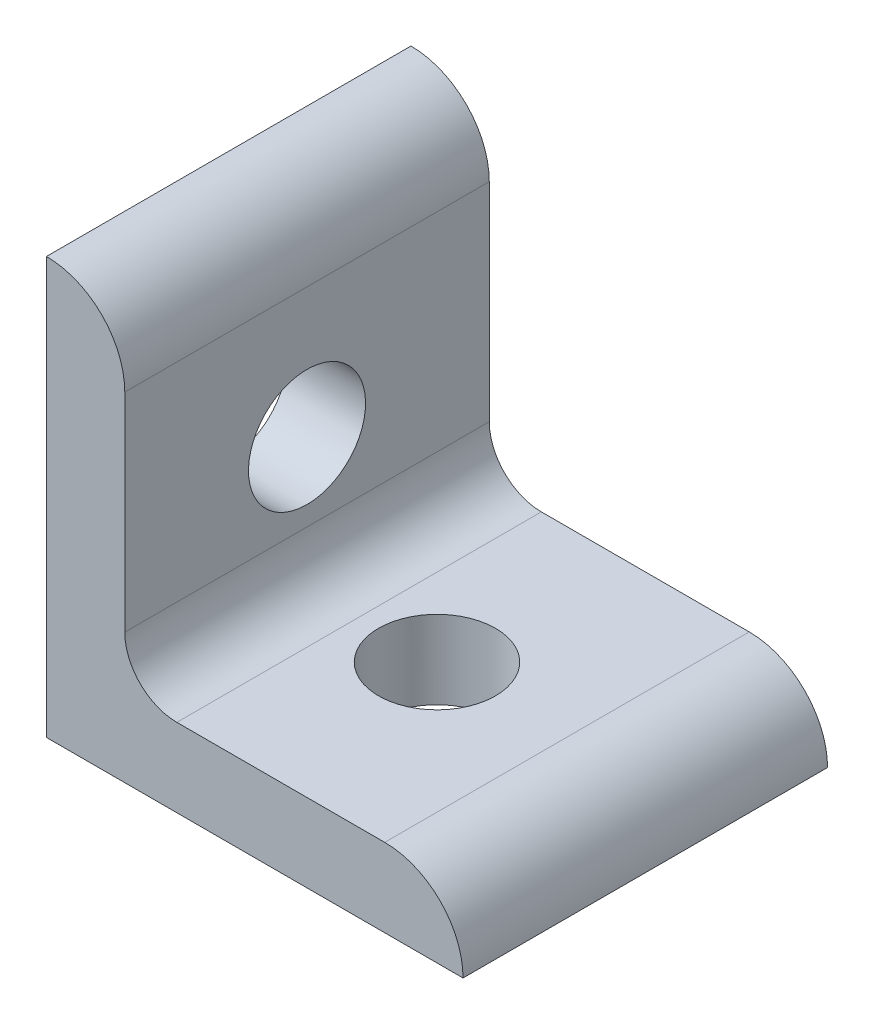
ISO-10303-21;
HEADER;
FILE_DESCRIPTION(('STEP AP214'),'2;1');
FILE_NAME('part.step','',(''),(''),'','','');
FILE_SCHEMA(('AUTOMOTIVE_DESIGN { 1 0 10303 214 1 1 1 1 }'));
ENDSEC;
DATA;
#1=APPLICATION_CONTEXT('core data for automotive mechanical design processes');
#2=APPLICATION_PROTOCOL_DEFINITION('international standard','automotive_design',2000,#1);
#3=PRODUCT_CONTEXT('',#1,'mechanical');
#4=PRODUCT('Part','Part','',(#3));
#5=PRODUCT_RELATED_PRODUCT_CATEGORY('part','',(#4));
#6=PRODUCT_DEFINITION_FORMATION('','',#4);
#7=PRODUCT_DEFINITION_CONTEXT('part definition',#1,'design');
#8=PRODUCT_DEFINITION('design','',#6,#7);
#9=PRODUCT_DEFINITION_SHAPE('','',#8);
#10=(LENGTH_UNIT() NAMED_UNIT(*) SI_UNIT(.MILLI.,.METRE.));
#11=(NAMED_UNIT(*) PLANE_ANGLE_UNIT() SI_UNIT($,.RADIAN.));
#12=(NAMED_UNIT(*) SI_UNIT($,.STERADIAN.) SOLID_ANGLE_UNIT());
#13=UNCERTAINTY_MEASURE_WITH_UNIT(LENGTH_MEASURE(1.E-05),#10,'distance_accuracy_value','');
#14=(GEOMETRIC_REPRESENTATION_CONTEXT(3) GLOBAL_UNCERTAINTY_ASSIGNED_CONTEXT((#13)) GLOBAL_UNIT_ASSIGNED_CONTEXT((#10,
#11,#12)) REPRESENTATION_CONTEXT('',''));
#15=CARTESIAN_POINT('',(0.,0.,0.));
#16=DIRECTION('',(0.,0.,1.));
#17=DIRECTION('',(1.,0.,0.));
#18=AXIS2_PLACEMENT_3D('',#15,#16,#17);
#19=CARTESIAN_POINT('',(4.7752,20.6248,11.1125));
#20=DIRECTION('',(-1.,0.,0.));
#21=DIRECTION('',(0.,-1.,0.));
#22=AXIS2_PLACEMENT_3D('',#19,#20,#21);
#23=PLANE('',#22);
#24=DIRECTION('',(0.,1.,0.));
#25=VECTOR('',#24,1.);
#26=CARTESIAN_POINT('',(4.7752,20.6248,-11.1125));
#27=LINE('',#26,#25);
#28=CARTESIAN_POINT('',(4.7752,7.9502,-11.1125));
#29=VERTEX_POINT('',#28);
#30=CARTESIAN_POINT('',(4.7752,20.6248,-11.1125));
#31=VERTEX_POINT('',#30);
#32=EDGE_CURVE('E120',#29,#31,#27,.T.);
#33=ORIENTED_EDGE('',*,*,#32,.T.);
#34=DIRECTION('',(0.,0.,-1.));
#35=VECTOR('',#34,1.);
#36=CARTESIAN_POINT('',(4.7752,20.6248,11.1125));
#37=LINE('',#36,#35);
#38=CARTESIAN_POINT('',(4.7752,20.6248,11.1125));
#39=VERTEX_POINT('',#38);
#40=EDGE_CURVE('E117',#39,#31,#37,.T.);
#41=ORIENTED_EDGE('',*,*,#40,.F.);
#42=DIRECTION('',(0.,1.,0.));
#43=VECTOR('',#42,1.);
#44=CARTESIAN_POINT('',(4.7752,20.6248,11.1125));
#45=LINE('',#44,#43);
#46=CARTESIAN_POINT('',(4.7752,7.9502,11.1125));
#47=VERTEX_POINT('',#46);
#48=EDGE_CURVE('E106',#47,#39,#45,.T.);
#49=ORIENTED_EDGE('',*,*,#48,.F.);
#50=DIRECTION('',(0.,0.,-1.));
#51=VECTOR('',#50,1.);
#52=CARTESIAN_POINT('',(4.7752,7.9502,11.1125));
#53=LINE('',#52,#51);
#54=EDGE_CURVE('E121',#47,#29,#53,.T.);
#55=ORIENTED_EDGE('',*,*,#54,.T.);
#56=EDGE_LOOP('',(#33,#41,#49,#55));
#57=FACE_BOUND('',#56,.T.);
#58=CARTESIAN_POINT('',(4.7752,12.7,0.));
#59=DIRECTION('',(-1.,0.,0.));
#60=DIRECTION('',(0.,-1.,0.));
#61=AXIS2_PLACEMENT_3D('',#58,#59,#60);
#62=CIRCLE('',#61,3.5687);
#63=CARTESIAN_POINT('',(4.7752,9.1313,0.));
#64=VERTEX_POINT('',#63);
#65=EDGE_CURVE('E170',#64,#64,#62,.F.);
#66=ORIENTED_EDGE('',*,*,#65,.F.);
#67=EDGE_LOOP('',(#66));
#68=FACE_BOUND('',#67,.T.);
#69=ADVANCED_FACE('F38',(#57,#68),#23,.F.);
#70=CARTESIAN_POINT('',(0.,0.,11.1125));
#71=DIRECTION('',(1.,0.,0.));
#72=DIRECTION('',(0.,0.,-1.));
#73=AXIS2_PLACEMENT_3D('',#70,#71,#72);
#74=PLANE('',#73);
#75=DIRECTION('',(0.,-1.,0.));
#76=VECTOR('',#75,1.);
#77=CARTESIAN_POINT('',(0.,0.,-11.1125));
#78=LINE('',#77,#76);
#79=CARTESIAN_POINT('',(0.,25.4,-11.1125));
#80=VERTEX_POINT('',#79);
#81=CARTESIAN_POINT('',(0.,0.,-11.1125));
#82=VERTEX_POINT('',#81);
#83=EDGE_CURVE('E88',#80,#82,#78,.T.);
#84=ORIENTED_EDGE('',*,*,#83,.T.);
#85=DIRECTION('',(0.,0.,-1.));
#86=VECTOR('',#85,1.);
#87=CARTESIAN_POINT('',(0.,0.,11.1125));
#88=LINE('',#87,#86);
#89=CARTESIAN_POINT('',(0.,0.,11.1125));
#90=VERTEX_POINT('',#89);
#91=EDGE_CURVE('E126',#90,#82,#88,.T.);
#92=ORIENTED_EDGE('',*,*,#91,.F.);
#93=DIRECTION('',(0.,-1.,0.));
#94=VECTOR('',#93,1.);
#95=CARTESIAN_POINT('',(0.,0.,11.1125));
#96=LINE('',#95,#94);
#97=CARTESIAN_POINT('',(0.,25.4,11.1125));
#98=VERTEX_POINT('',#97);
#99=EDGE_CURVE('E56',#98,#90,#96,.T.);
#100=ORIENTED_EDGE('',*,*,#99,.F.);
#101=DIRECTION('',(0.,0.,-1.));
#102=VECTOR('',#101,1.);
#103=CARTESIAN_POINT('',(0.,25.4,11.1125));
#104=LINE('',#103,#102);
#105=EDGE_CURVE('E122',#98,#80,#104,.T.);
#106=ORIENTED_EDGE('',*,*,#105,.T.);
#107=EDGE_LOOP('',(#84,#92,#100,#106));
#108=FACE_BOUND('',#107,.T.);
#109=CARTESIAN_POINT('',(0.,12.7,0.));
#110=DIRECTION('',(1.,0.,0.));
#111=DIRECTION('',(0.,0.,-1.));
#112=AXIS2_PLACEMENT_3D('',#109,#110,#111);
#113=CIRCLE('',#112,3.5687);
#114=CARTESIAN_POINT('',(0.,12.7,-3.5687));
#115=VERTEX_POINT('',#114);
#116=EDGE_CURVE('E173',#115,#115,#113,.T.);
#117=ORIENTED_EDGE('',*,*,#116,.T.);
#118=EDGE_LOOP('',(#117));
#119=FACE_BOUND('',#118,.T.);
#120=ADVANCED_FACE('F177',(#108,#119),#74,.F.);
#121=CARTESIAN_POINT('',(25.4,0.,11.1125));
#122=DIRECTION('',(0.,1.,0.));
#123=DIRECTION('',(-1.,0.,0.));
#124=AXIS2_PLACEMENT_3D('',#121,#122,#123);
#125=PLANE('',#124);
#126=DIRECTION('',(1.,0.,0.));
#127=VECTOR('',#126,1.);
#128=CARTESIAN_POINT('',(25.4,0.,-11.1125));
#129=LINE('',#128,#127);
#130=CARTESIAN_POINT('',(25.4,0.,-11.1125));
#131=VERTEX_POINT('',#130);
#132=EDGE_CURVE('E130',#82,#131,#129,.T.);
#133=ORIENTED_EDGE('',*,*,#132,.T.);
#134=DIRECTION('',(0.,0.,-1.));
#135=VECTOR('',#134,1.);
#136=CARTESIAN_POINT('',(25.4,0.,11.1125));
#137=LINE('',#136,#135);
#138=CARTESIAN_POINT('',(25.4,0.,11.1125));
#139=VERTEX_POINT('',#138);
#140=EDGE_CURVE('E11',#139,#131,#137,.T.);
#141=ORIENTED_EDGE('',*,*,#140,.F.);
#142=DIRECTION('',(1.,0.,0.));
#143=VECTOR('',#142,1.);
#144=CARTESIAN_POINT('',(25.4,0.,11.1125));
#145=LINE('',#144,#143);
#146=EDGE_CURVE('E142',#90,#139,#145,.T.);
#147=ORIENTED_EDGE('',*,*,#146,.F.);
#148=ORIENTED_EDGE('',*,*,#91,.T.);
#149=EDGE_LOOP('',(#133,#141,#147,#148));
#150=FACE_BOUND('',#149,.T.);
#151=CARTESIAN_POINT('',(12.7,0.,0.));
#152=DIRECTION('',(0.,1.,0.));
#153=DIRECTION('',(0.,0.,1.));
#154=AXIS2_PLACEMENT_3D('',#151,#152,#153);
#155=CIRCLE('',#154,3.5687);
#156=CARTESIAN_POINT('',(12.7,0.,3.5687));
#157=VERTEX_POINT('',#156);
#158=EDGE_CURVE('E167',#157,#157,#155,.T.);
#159=ORIENTED_EDGE('',*,*,#158,.T.);
#160=EDGE_LOOP('',(#159));
#161=FACE_BOUND('',#160,.T.);
#162=ADVANCED_FACE('F40',(#150,#161),#125,.F.);
#163=CARTESIAN_POINT('',(7.9502,4.7752,11.1125));
#164=DIRECTION('',(0.,-1.,0.));
#165=DIRECTION('',(0.,0.,-1.));
#166=AXIS2_PLACEMENT_3D('',#163,#164,#165);
#167=PLANE('',#166);
#168=DIRECTION('',(-1.,0.,0.));
#169=VECTOR('',#168,1.);
#170=CARTESIAN_POINT('',(7.9502,4.7752,-11.1125));
#171=LINE('',#170,#169);
#172=CARTESIAN_POINT('',(20.6248,4.7752,-11.1125));
#173=VERTEX_POINT('',#172);
#174=CARTESIAN_POINT('',(7.9502,4.7752,-11.1125));
#175=VERTEX_POINT('',#174);
#176=EDGE_CURVE('E135',#173,#175,#171,.T.);
#177=ORIENTED_EDGE('',*,*,#176,.T.);
#178=DIRECTION('',(0.,0.,-1.));
#179=VECTOR('',#178,1.);
#180=CARTESIAN_POINT('',(7.9502,4.7752,11.1125));
#181=LINE('',#180,#179);
#182=CARTESIAN_POINT('',(7.9502,4.7752,11.1125));
#183=VERTEX_POINT('',#182);
#184=EDGE_CURVE('E146',#183,#175,#181,.T.);
#185=ORIENTED_EDGE('',*,*,#184,.F.);
#186=DIRECTION('',(-1.,0.,0.));
#187=VECTOR('',#186,1.);
#188=CARTESIAN_POINT('',(7.9502,4.7752,11.1125));
#189=LINE('',#188,#187);
#190=CARTESIAN_POINT('',(20.6248,4.7752,11.1125));
#191=VERTEX_POINT('',#190);
#192=EDGE_CURVE('E156',#191,#183,#189,.T.);
#193=ORIENTED_EDGE('',*,*,#192,.F.);
#194=DIRECTION('',(0.,0.,-1.));
#195=VECTOR('',#194,1.);
#196=CARTESIAN_POINT('',(20.6248,4.7752,11.1125));
#197=LINE('',#196,#195);
#198=EDGE_CURVE('E48',#191,#173,#197,.T.);
#199=ORIENTED_EDGE('',*,*,#198,.T.);
#200=EDGE_LOOP('',(#177,#185,#193,#199));
#201=FACE_BOUND('',#200,.T.);
#202=CARTESIAN_POINT('',(12.7,4.7752,0.));
#203=DIRECTION('',(0.,-1.,0.));
#204=DIRECTION('',(0.,0.,-1.));
#205=AXIS2_PLACEMENT_3D('',#202,#203,#204);
#206=CIRCLE('',#205,3.5687);
#207=CARTESIAN_POINT('',(12.7,4.7752,-3.5687));
#208=VERTEX_POINT('',#207);
#209=EDGE_CURVE('E42',#208,#208,#206,.F.);
#210=ORIENTED_EDGE('',*,*,#209,.F.);
#211=EDGE_LOOP('',(#210));
#212=FACE_BOUND('',#211,.T.);
#213=ADVANCED_FACE('F153',(#201,#212),#167,.F.);
#214=CARTESIAN_POINT('',(20.6248,0.,11.1125));
#215=DIRECTION('',(0.,0.,-1.));
#216=DIRECTION('',(-1.,0.,0.));
#217=AXIS2_PLACEMENT_3D('',#214,#215,#216);
#218=CYLINDRICAL_SURFACE('',#217,4.7752);
#219=CARTESIAN_POINT('',(20.6248,0.,-11.1125));
#220=DIRECTION('',(0.,0.,1.));
#221=DIRECTION('',(1.,0.,0.));
#222=AXIS2_PLACEMENT_3D('',#219,#220,#221);
#223=CIRCLE('',#222,4.7752);
#224=EDGE_CURVE('E133',#131,#173,#223,.T.);
#225=ORIENTED_EDGE('',*,*,#224,.T.);
#226=ORIENTED_EDGE('',*,*,#198,.F.);
#227=CARTESIAN_POINT('',(20.6248,0.,11.1125));
#228=DIRECTION('',(0.,0.,1.));
#229=DIRECTION('',(1.,0.,0.));
#230=AXIS2_PLACEMENT_3D('',#227,#228,#229);
#231=CIRCLE('',#230,4.7752);
#232=EDGE_CURVE('E96',#139,#191,#231,.T.);
#233=ORIENTED_EDGE('',*,*,#232,.F.);
#234=ORIENTED_EDGE('',*,*,#140,.T.);
#235=EDGE_LOOP('',(#225,#226,#233,#234));
#236=FACE_BOUND('',#235,.T.);
#237=ADVANCED_FACE('F195',(#236),#218,.T.);
#238=CARTESIAN_POINT('',(7.9502,7.9502,11.1125));
#239=DIRECTION('',(0.,0.,-1.));
#240=DIRECTION('',(-1.,0.,0.));
#241=AXIS2_PLACEMENT_3D('',#238,#239,#240);
#242=CYLINDRICAL_SURFACE('',#241,3.175);
#243=CARTESIAN_POINT('',(7.9502,7.9502,-11.1125));
#244=DIRECTION('',(0.,0.,-1.));
#245=DIRECTION('',(1.,0.,0.));
#246=AXIS2_PLACEMENT_3D('',#243,#244,#245);
#247=CIRCLE('',#246,3.175);
#248=EDGE_CURVE('E137',#175,#29,#247,.T.);
#249=ORIENTED_EDGE('',*,*,#248,.T.);
#250=ORIENTED_EDGE('',*,*,#54,.F.);
#251=CARTESIAN_POINT('',(7.9502,7.9502,11.1125));
#252=DIRECTION('',(0.,0.,-1.));
#253=DIRECTION('',(1.,0.,0.));
#254=AXIS2_PLACEMENT_3D('',#251,#252,#253);
#255=CIRCLE('',#254,3.175);
#256=EDGE_CURVE('E112',#183,#47,#255,.T.);
#257=ORIENTED_EDGE('',*,*,#256,.F.);
#258=ORIENTED_EDGE('',*,*,#184,.T.);
#259=EDGE_LOOP('',(#249,#250,#257,#258));
#260=FACE_BOUND('',#259,.T.);
#261=ADVANCED_FACE('F162',(#260),#242,.F.);
#262=CARTESIAN_POINT('',(0.,20.6248,11.1125));
#263=DIRECTION('',(0.,0.,-1.));
#264=DIRECTION('',(-1.,0.,0.));
#265=AXIS2_PLACEMENT_3D('',#262,#263,#264);
#266=CYLINDRICAL_SURFACE('',#265,4.7752);
#267=CARTESIAN_POINT('',(0.,20.6248,-11.1125));
#268=DIRECTION('',(0.,0.,1.));
#269=DIRECTION('',(1.,0.,0.));
#270=AXIS2_PLACEMENT_3D('',#267,#268,#269);
#271=CIRCLE('',#270,4.7752);
#272=EDGE_CURVE('E82',#31,#80,#271,.T.);
#273=ORIENTED_EDGE('',*,*,#272,.T.);
#274=ORIENTED_EDGE('',*,*,#105,.F.);
#275=CARTESIAN_POINT('',(0.,20.6248,11.1125));
#276=DIRECTION('',(0.,0.,1.));
#277=DIRECTION('',(1.,0.,0.));
#278=AXIS2_PLACEMENT_3D('',#275,#276,#277);
#279=CIRCLE('',#278,4.7752);
#280=EDGE_CURVE('E110',#39,#98,#279,.T.);
#281=ORIENTED_EDGE('',*,*,#280,.F.);
#282=ORIENTED_EDGE('',*,*,#40,.T.);
#283=EDGE_LOOP('',(#273,#274,#281,#282));
#284=FACE_BOUND('',#283,.T.);
#285=ADVANCED_FACE('F124',(#284),#266,.T.);
#286=CARTESIAN_POINT('',(0.,20.6248,11.1125));
#287=DIRECTION('',(0.,0.,1.));
#288=DIRECTION('',(1.,0.,0.));
#289=AXIS2_PLACEMENT_3D('',#286,#287,#288);
#290=PLANE('',#289);
#291=ORIENTED_EDGE('',*,*,#146,.T.);
#292=ORIENTED_EDGE('',*,*,#232,.T.);
#293=ORIENTED_EDGE('',*,*,#192,.T.);
#294=ORIENTED_EDGE('',*,*,#256,.T.);
#295=ORIENTED_EDGE('',*,*,#48,.T.);
#296=ORIENTED_EDGE('',*,*,#280,.T.);
#297=ORIENTED_EDGE('',*,*,#99,.T.);
#298=EDGE_LOOP('',(#291,#292,#293,#294,#295,#296,#297));
#299=FACE_BOUND('',#298,.T.);
#300=ADVANCED_FACE('F108',(#299),#290,.T.);
#301=CARTESIAN_POINT('',(0.,20.6248,-11.1125));
#302=DIRECTION('',(0.,0.,1.));
#303=DIRECTION('',(1.,0.,0.));
#304=AXIS2_PLACEMENT_3D('',#301,#302,#303);
#305=PLANE('',#304);
#306=ORIENTED_EDGE('',*,*,#132,.F.);
#307=ORIENTED_EDGE('',*,*,#83,.F.);
#308=ORIENTED_EDGE('',*,*,#272,.F.);
#309=ORIENTED_EDGE('',*,*,#32,.F.);
#310=ORIENTED_EDGE('',*,*,#248,.F.);
#311=ORIENTED_EDGE('',*,*,#176,.F.);
#312=ORIENTED_EDGE('',*,*,#224,.F.);
#313=EDGE_LOOP('',(#306,#307,#308,#309,#310,#311,#312));
#314=FACE_BOUND('',#313,.T.);
#315=ADVANCED_FACE('F160',(#314),#305,.F.);
#316=CARTESIAN_POINT('',(12.7,25.4,0.));
#317=DIRECTION('',(0.,-1.,0.));
#318=DIRECTION('',(0.,0.,-1.));
#319=AXIS2_PLACEMENT_3D('',#316,#317,#318);
#320=CYLINDRICAL_SURFACE('',#319,3.5687);
#321=ORIENTED_EDGE('',*,*,#158,.F.);
#322=EDGE_LOOP('',(#321));
#323=FACE_BOUND('',#322,.T.);
#324=ORIENTED_EDGE('',*,*,#209,.T.);
#325=EDGE_LOOP('',(#324));
#326=FACE_BOUND('',#325,.T.);
#327=ADVANCED_FACE('F182',(#323,#326),#320,.F.);
#328=CARTESIAN_POINT('',(25.4,12.7,0.));
#329=DIRECTION('',(-1.,0.,0.));
#330=DIRECTION('',(0.,0.,1.));
#331=AXIS2_PLACEMENT_3D('',#328,#329,#330);
#332=CYLINDRICAL_SURFACE('',#331,3.5687);
#333=ORIENTED_EDGE('',*,*,#116,.F.);
#334=EDGE_LOOP('',(#333));
#335=FACE_BOUND('',#334,.T.);
#336=ORIENTED_EDGE('',*,*,#65,.T.);
#337=EDGE_LOOP('',(#336));
#338=FACE_BOUND('',#337,.T.);
#339=ADVANCED_FACE('F179',(#335,#338),#332,.F.);
#340=CLOSED_SHELL('',(#69,#120,#162,#213,#237,#261,#285,#300,#315,#327,#339));
#341=MANIFOLD_SOLID_BREP('B2',#340);
#342=ADVANCED_BREP_SHAPE_REPRESENTATION('',(#18,#341),#14);
#343=SHAPE_DEFINITION_REPRESENTATION(#9,#342);
ENDSEC;
END-ISO-10303-21;
